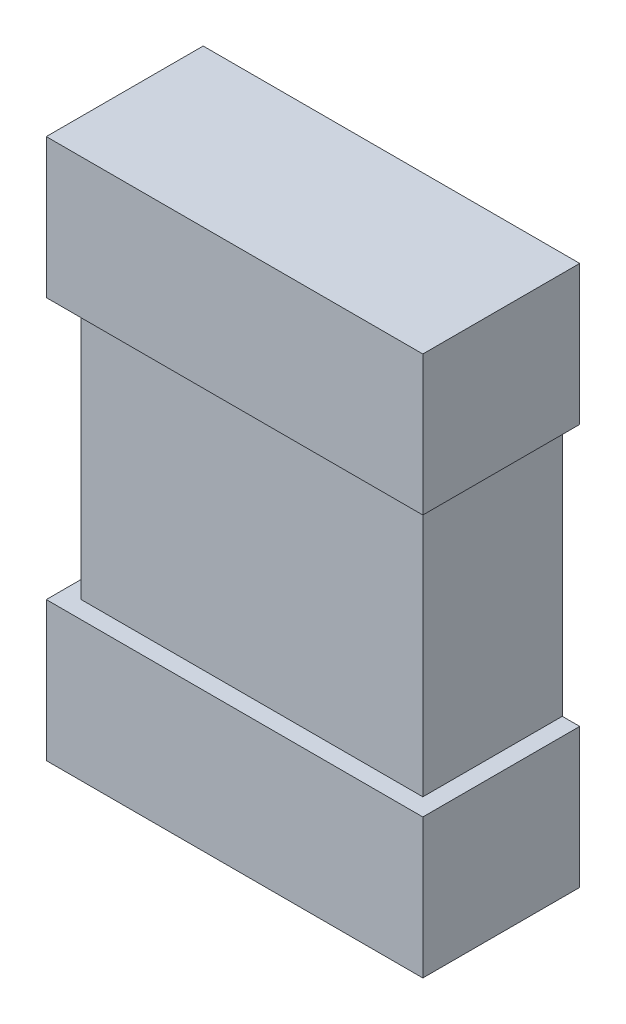
ISO-10303-21;
HEADER;
FILE_DESCRIPTION(('STEP AP214'),'2;1');
FILE_NAME('part.step','',(''),(''),'','','');
FILE_SCHEMA(('AUTOMOTIVE_DESIGN { 1 0 10303 214 1 1 1 1 }'));
ENDSEC;
DATA;
#1=APPLICATION_CONTEXT('core data for automotive mechanical design processes');
#2=APPLICATION_PROTOCOL_DEFINITION('international standard','automotive_design',2000,#1);
#3=PRODUCT_CONTEXT('',#1,'mechanical');
#4=PRODUCT('Part','Part','',(#3));
#5=PRODUCT_RELATED_PRODUCT_CATEGORY('part','',(#4));
#6=PRODUCT_DEFINITION_FORMATION('','',#4);
#7=PRODUCT_DEFINITION_CONTEXT('part definition',#1,'design');
#8=PRODUCT_DEFINITION('design','',#6,#7);
#9=PRODUCT_DEFINITION_SHAPE('','',#8);
#10=(LENGTH_UNIT() NAMED_UNIT(*) SI_UNIT(.MILLI.,.METRE.));
#11=(NAMED_UNIT(*) PLANE_ANGLE_UNIT() SI_UNIT($,.RADIAN.));
#12=(NAMED_UNIT(*) SI_UNIT($,.STERADIAN.) SOLID_ANGLE_UNIT());
#13=UNCERTAINTY_MEASURE_WITH_UNIT(LENGTH_MEASURE(1.E-05),#10,'distance_accuracy_value','');
#14=(GEOMETRIC_REPRESENTATION_CONTEXT(3) GLOBAL_UNCERTAINTY_ASSIGNED_CONTEXT((#13)) GLOBAL_UNIT_ASSIGNED_CONTEXT((#10,
#11,#12)) REPRESENTATION_CONTEXT('',''));
#15=CARTESIAN_POINT('',(0.,0.,0.));
#16=DIRECTION('',(0.,0.,1.));
#17=DIRECTION('',(1.,0.,0.));
#18=AXIS2_PLACEMENT_3D('',#15,#16,#17);
#19=CARTESIAN_POINT('',(-0.54,-0.775,0.45));
#20=DIRECTION('',(0.,0.,1.));
#21=DIRECTION('',(1.,0.,0.));
#22=AXIS2_PLACEMENT_3D('',#19,#20,#21);
#23=PLANE('',#22);
#24=DIRECTION('',(-1.,0.,0.));
#25=VECTOR('',#24,1.);
#26=CARTESIAN_POINT('',(-0.49,0.375,0.45));
#27=LINE('',#26,#25);
#28=CARTESIAN_POINT('',(0.54,0.375,0.45));
#29=VERTEX_POINT('',#28);
#30=CARTESIAN_POINT('',(-0.54,0.375,0.45));
#31=VERTEX_POINT('',#30);
#32=EDGE_CURVE('E154',#29,#31,#27,.T.);
#33=ORIENTED_EDGE('',*,*,#32,.F.);
#34=DIRECTION('',(0.,1.,0.));
#35=VECTOR('',#34,1.);
#36=CARTESIAN_POINT('',(0.54,-0.775,0.45));
#37=LINE('',#36,#35);
#38=CARTESIAN_POINT('',(0.54,0.775,0.45));
#39=VERTEX_POINT('',#38);
#40=EDGE_CURVE('E193',#29,#39,#37,.T.);
#41=ORIENTED_EDGE('',*,*,#40,.T.);
#42=DIRECTION('',(-1.,0.,0.));
#43=VECTOR('',#42,1.);
#44=CARTESIAN_POINT('',(0.54,0.775,0.45));
#45=LINE('',#44,#43);
#46=CARTESIAN_POINT('',(-0.54,0.775,0.45));
#47=VERTEX_POINT('',#46);
#48=EDGE_CURVE('E197',#39,#47,#45,.T.);
#49=ORIENTED_EDGE('',*,*,#48,.T.);
#50=DIRECTION('',(0.,-1.,0.));
#51=VECTOR('',#50,1.);
#52=CARTESIAN_POINT('',(-0.54,0.775,0.45));
#53=LINE('',#52,#51);
#54=EDGE_CURVE('E188',#47,#31,#53,.T.);
#55=ORIENTED_EDGE('',*,*,#54,.T.);
#56=EDGE_LOOP('',(#33,#41,#49,#55));
#57=FACE_BOUND('',#56,.T.);
#58=ADVANCED_FACE('F36',(#57),#23,.T.);
#59=CARTESIAN_POINT('',(0.54,-0.775,0.45));
#60=DIRECTION('',(-1.,0.,0.));
#61=DIRECTION('',(0.,0.,1.));
#62=AXIS2_PLACEMENT_3D('',#59,#60,#61);
#63=PLANE('',#62);
#64=DIRECTION('',(0.,1.,0.));
#65=VECTOR('',#64,1.);
#66=CARTESIAN_POINT('',(0.54,-0.775,0.));
#67=LINE('',#66,#65);
#68=CARTESIAN_POINT('',(0.54,-0.775,0.));
#69=VERTEX_POINT('',#68);
#70=CARTESIAN_POINT('',(0.54,-0.375,0.));
#71=VERTEX_POINT('',#70);
#72=EDGE_CURVE('E182',#69,#71,#67,.T.);
#73=ORIENTED_EDGE('',*,*,#72,.T.);
#74=DIRECTION('',(0.,0.,1.));
#75=VECTOR('',#74,1.);
#76=CARTESIAN_POINT('',(0.54,-0.375,0.));
#77=LINE('',#76,#75);
#78=CARTESIAN_POINT('',(0.54,-0.375,0.45));
#79=VERTEX_POINT('',#78);
#80=EDGE_CURVE('E142',#71,#79,#77,.T.);
#81=ORIENTED_EDGE('',*,*,#80,.T.);
#82=CARTESIAN_POINT('',(0.54,-0.775,0.45));
#83=VERTEX_POINT('',#82);
#84=EDGE_CURVE('E194',#83,#79,#37,.T.);
#85=ORIENTED_EDGE('',*,*,#84,.F.);
#86=DIRECTION('',(0.,0.,-1.));
#87=VECTOR('',#86,1.);
#88=CARTESIAN_POINT('',(0.54,-0.775,0.45));
#89=LINE('',#88,#87);
#90=EDGE_CURVE('E44',#83,#69,#89,.T.);
#91=ORIENTED_EDGE('',*,*,#90,.T.);
#92=EDGE_LOOP('',(#73,#81,#85,#91));
#93=FACE_BOUND('',#92,.T.);
#94=ADVANCED_FACE('F209',(#93),#63,.F.);
#95=CARTESIAN_POINT('',(-0.54,0.775,0.45));
#96=DIRECTION('',(1.,0.,0.));
#97=DIRECTION('',(0.,0.,-1.));
#98=AXIS2_PLACEMENT_3D('',#95,#96,#97);
#99=PLANE('',#98);
#100=DIRECTION('',(0.,-1.,0.));
#101=VECTOR('',#100,1.);
#102=CARTESIAN_POINT('',(-0.54,0.775,0.));
#103=LINE('',#102,#101);
#104=CARTESIAN_POINT('',(-0.54,0.775,0.));
#105=VERTEX_POINT('',#104);
#106=CARTESIAN_POINT('',(-0.54,0.375,0.));
#107=VERTEX_POINT('',#106);
#108=EDGE_CURVE('E176',#105,#107,#103,.T.);
#109=ORIENTED_EDGE('',*,*,#108,.T.);
#110=DIRECTION('',(0.,0.,1.));
#111=VECTOR('',#110,1.);
#112=CARTESIAN_POINT('',(-0.54,0.375,0.));
#113=LINE('',#112,#111);
#114=EDGE_CURVE('E167',#107,#31,#113,.T.);
#115=ORIENTED_EDGE('',*,*,#114,.T.);
#116=ORIENTED_EDGE('',*,*,#54,.F.);
#117=DIRECTION('',(0.,0.,-1.));
#118=VECTOR('',#117,1.);
#119=CARTESIAN_POINT('',(-0.54,0.775,0.45));
#120=LINE('',#119,#118);
#121=EDGE_CURVE('E199',#47,#105,#120,.T.);
#122=ORIENTED_EDGE('',*,*,#121,.T.);
#123=EDGE_LOOP('',(#109,#115,#116,#122));
#124=FACE_BOUND('',#123,.T.);
#125=ADVANCED_FACE('F244',(#124),#99,.F.);
#126=CARTESIAN_POINT('',(-0.54,-0.375,0.45));
#127=VERTEX_POINT('',#126);
#128=CARTESIAN_POINT('',(-0.54,-0.775,0.45));
#129=VERTEX_POINT('',#128);
#130=EDGE_CURVE('E187',#127,#129,#53,.T.);
#131=ORIENTED_EDGE('',*,*,#130,.F.);
#132=DIRECTION('',(0.,0.,1.));
#133=VECTOR('',#132,1.);
#134=CARTESIAN_POINT('',(-0.54,-0.375,0.));
#135=LINE('',#134,#133);
#136=CARTESIAN_POINT('',(-0.54,-0.375,0.));
#137=VERTEX_POINT('',#136);
#138=EDGE_CURVE('E166',#137,#127,#135,.T.);
#139=ORIENTED_EDGE('',*,*,#138,.F.);
#140=CARTESIAN_POINT('',(-0.54,-0.775,0.));
#141=VERTEX_POINT('',#140);
#142=EDGE_CURVE('E169',#137,#141,#103,.T.);
#143=ORIENTED_EDGE('',*,*,#142,.T.);
#144=DIRECTION('',(0.,0.,-1.));
#145=VECTOR('',#144,1.);
#146=CARTESIAN_POINT('',(-0.54,-0.775,0.45));
#147=LINE('',#146,#145);
#148=EDGE_CURVE('E11',#129,#141,#147,.T.);
#149=ORIENTED_EDGE('',*,*,#148,.F.);
#150=EDGE_LOOP('',(#131,#139,#143,#149));
#151=FACE_BOUND('',#150,.T.);
#152=ADVANCED_FACE('F38',(#151),#99,.F.);
#153=CARTESIAN_POINT('',(-0.54,-0.775,0.45));
#154=DIRECTION('',(0.,1.,0.));
#155=DIRECTION('',(0.,0.,1.));
#156=AXIS2_PLACEMENT_3D('',#153,#154,#155);
#157=PLANE('',#156);
#158=DIRECTION('',(1.,0.,0.));
#159=VECTOR('',#158,1.);
#160=CARTESIAN_POINT('',(-0.54,-0.775,0.));
#161=LINE('',#160,#159);
#162=EDGE_CURVE('E179',#141,#69,#161,.T.);
#163=ORIENTED_EDGE('',*,*,#162,.T.);
#164=ORIENTED_EDGE('',*,*,#90,.F.);
#165=DIRECTION('',(1.,0.,0.));
#166=VECTOR('',#165,1.);
#167=CARTESIAN_POINT('',(-0.54,-0.775,0.45));
#168=LINE('',#167,#166);
#169=EDGE_CURVE('E191',#129,#83,#168,.T.);
#170=ORIENTED_EDGE('',*,*,#169,.F.);
#171=ORIENTED_EDGE('',*,*,#148,.T.);
#172=EDGE_LOOP('',(#163,#164,#170,#171));
#173=FACE_BOUND('',#172,.T.);
#174=ADVANCED_FACE('F234',(#173),#157,.F.);
#175=ORIENTED_EDGE('',*,*,#40,.F.);
#176=DIRECTION('',(0.,0.,1.));
#177=VECTOR('',#176,1.);
#178=CARTESIAN_POINT('',(0.54,0.375,0.));
#179=LINE('',#178,#177);
#180=CARTESIAN_POINT('',(0.54,0.375,0.));
#181=VERTEX_POINT('',#180);
#182=EDGE_CURVE('E147',#181,#29,#179,.T.);
#183=ORIENTED_EDGE('',*,*,#182,.F.);
#184=CARTESIAN_POINT('',(0.54,0.775,0.));
#185=VERTEX_POINT('',#184);
#186=EDGE_CURVE('E181',#181,#185,#67,.T.);
#187=ORIENTED_EDGE('',*,*,#186,.T.);
#188=DIRECTION('',(0.,0.,-1.));
#189=VECTOR('',#188,1.);
#190=CARTESIAN_POINT('',(0.54,0.775,0.45));
#191=LINE('',#190,#189);
#192=EDGE_CURVE('E202',#39,#185,#191,.T.);
#193=ORIENTED_EDGE('',*,*,#192,.F.);
#194=EDGE_LOOP('',(#175,#183,#187,#193));
#195=FACE_BOUND('',#194,.T.);
#196=ADVANCED_FACE('F236',(#195),#63,.F.);
#197=CARTESIAN_POINT('',(0.54,0.775,0.45));
#198=DIRECTION('',(0.,-1.,0.));
#199=DIRECTION('',(0.,0.,-1.));
#200=AXIS2_PLACEMENT_3D('',#197,#198,#199);
#201=PLANE('',#200);
#202=DIRECTION('',(-1.,0.,0.));
#203=VECTOR('',#202,1.);
#204=CARTESIAN_POINT('',(0.54,0.775,0.));
#205=LINE('',#204,#203);
#206=EDGE_CURVE('E185',#185,#105,#205,.T.);
#207=ORIENTED_EDGE('',*,*,#206,.T.);
#208=ORIENTED_EDGE('',*,*,#121,.F.);
#209=ORIENTED_EDGE('',*,*,#48,.F.);
#210=ORIENTED_EDGE('',*,*,#192,.T.);
#211=EDGE_LOOP('',(#207,#208,#209,#210));
#212=FACE_BOUND('',#211,.T.);
#213=ADVANCED_FACE('F241',(#212),#201,.F.);
#214=ORIENTED_EDGE('',*,*,#84,.T.);
#215=DIRECTION('',(1.,0.,0.));
#216=VECTOR('',#215,1.);
#217=CARTESIAN_POINT('',(-0.54,-0.375,0.45));
#218=LINE('',#217,#216);
#219=EDGE_CURVE('E145',#127,#79,#218,.T.);
#220=ORIENTED_EDGE('',*,*,#219,.F.);
#221=ORIENTED_EDGE('',*,*,#130,.T.);
#222=ORIENTED_EDGE('',*,*,#169,.T.);
#223=EDGE_LOOP('',(#214,#220,#221,#222));
#224=FACE_BOUND('',#223,.T.);
#225=ADVANCED_FACE('F233',(#224),#23,.T.);
#226=CARTESIAN_POINT('',(-0.54,-0.775,0.));
#227=DIRECTION('',(0.,0.,1.));
#228=DIRECTION('',(1.,0.,0.));
#229=AXIS2_PLACEMENT_3D('',#226,#227,#228);
#230=PLANE('',#229);
#231=DIRECTION('',(0.,-1.,0.));
#232=VECTOR('',#231,1.);
#233=CARTESIAN_POINT('',(0.49,-0.375,0.));
#234=LINE('',#233,#232);
#235=CARTESIAN_POINT('',(0.49,0.375,0.));
#236=VERTEX_POINT('',#235);
#237=CARTESIAN_POINT('',(0.49,-0.375,0.));
#238=VERTEX_POINT('',#237);
#239=EDGE_CURVE('E59',#236,#238,#234,.T.);
#240=ORIENTED_EDGE('',*,*,#239,.T.);
#241=DIRECTION('',(1.,0.,0.));
#242=VECTOR('',#241,1.);
#243=CARTESIAN_POINT('',(0.49,-0.375,0.));
#244=LINE('',#243,#242);
#245=EDGE_CURVE('E141',#238,#71,#244,.T.);
#246=ORIENTED_EDGE('',*,*,#245,.T.);
#247=ORIENTED_EDGE('',*,*,#72,.F.);
#248=ORIENTED_EDGE('',*,*,#162,.F.);
#249=ORIENTED_EDGE('',*,*,#142,.F.);
#250=DIRECTION('',(1.,0.,0.));
#251=VECTOR('',#250,1.);
#252=CARTESIAN_POINT('',(-0.54,-0.375,0.));
#253=LINE('',#252,#251);
#254=CARTESIAN_POINT('',(-0.49,-0.375,0.));
#255=VERTEX_POINT('',#254);
#256=EDGE_CURVE('E157',#137,#255,#253,.T.);
#257=ORIENTED_EDGE('',*,*,#256,.T.);
#258=DIRECTION('',(0.,1.,0.));
#259=VECTOR('',#258,1.);
#260=CARTESIAN_POINT('',(-0.49,0.375,0.));
#261=LINE('',#260,#259);
#262=CARTESIAN_POINT('',(-0.49,0.375,0.));
#263=VERTEX_POINT('',#262);
#264=EDGE_CURVE('E160',#255,#263,#261,.T.);
#265=ORIENTED_EDGE('',*,*,#264,.T.);
#266=DIRECTION('',(-1.,0.,0.));
#267=VECTOR('',#266,1.);
#268=CARTESIAN_POINT('',(-0.49,0.375,0.));
#269=LINE('',#268,#267);
#270=EDGE_CURVE('E163',#263,#107,#269,.T.);
#271=ORIENTED_EDGE('',*,*,#270,.T.);
#272=ORIENTED_EDGE('',*,*,#108,.F.);
#273=ORIENTED_EDGE('',*,*,#206,.F.);
#274=ORIENTED_EDGE('',*,*,#186,.F.);
#275=DIRECTION('',(-1.,0.,0.));
#276=VECTOR('',#275,1.);
#277=CARTESIAN_POINT('',(0.54,0.375,0.));
#278=LINE('',#277,#276);
#279=EDGE_CURVE('E217',#181,#236,#278,.T.);
#280=ORIENTED_EDGE('',*,*,#279,.T.);
#281=EDGE_LOOP('',(#240,#246,#247,#248,#249,#257,#265,#271,#272,#273,#274,#280));
#282=FACE_BOUND('',#281,.T.);
#283=ADVANCED_FACE('F214',(#282),#230,.F.);
#284=CARTESIAN_POINT('',(-0.49,0.375,0.));
#285=DIRECTION('',(0.,1.,0.));
#286=DIRECTION('',(0.,0.,1.));
#287=AXIS2_PLACEMENT_3D('',#284,#285,#286);
#288=PLANE('',#287);
#289=DIRECTION('',(0.,0.,1.));
#290=VECTOR('',#289,1.);
#291=CARTESIAN_POINT('',(-0.49,0.375,0.));
#292=LINE('',#291,#290);
#293=CARTESIAN_POINT('',(-0.49,0.375,0.4));
#294=VERTEX_POINT('',#293);
#295=EDGE_CURVE('E170',#263,#294,#292,.T.);
#296=ORIENTED_EDGE('',*,*,#295,.T.);
#297=DIRECTION('',(1.,0.,0.));
#298=VECTOR('',#297,1.);
#299=CARTESIAN_POINT('',(-0.54,0.375,0.4));
#300=LINE('',#299,#298);
#301=CARTESIAN_POINT('',(0.49,0.375,0.4));
#302=VERTEX_POINT('',#301);
#303=EDGE_CURVE('E132',#294,#302,#300,.T.);
#304=ORIENTED_EDGE('',*,*,#303,.T.);
#305=DIRECTION('',(0.,0.,1.));
#306=VECTOR('',#305,1.);
#307=CARTESIAN_POINT('',(0.49,0.375,0.));
#308=LINE('',#307,#306);
#309=EDGE_CURVE('E137',#236,#302,#308,.T.);
#310=ORIENTED_EDGE('',*,*,#309,.F.);
#311=ORIENTED_EDGE('',*,*,#279,.F.);
#312=ORIENTED_EDGE('',*,*,#182,.T.);
#313=ORIENTED_EDGE('',*,*,#32,.T.);
#314=ORIENTED_EDGE('',*,*,#114,.F.);
#315=ORIENTED_EDGE('',*,*,#270,.F.);
#316=EDGE_LOOP('',(#296,#304,#310,#311,#312,#313,#314,#315));
#317=FACE_BOUND('',#316,.T.);
#318=ADVANCED_FACE('F223',(#317),#288,.F.);
#319=CARTESIAN_POINT('',(-0.49,0.375,0.));
#320=DIRECTION('',(1.,0.,0.));
#321=DIRECTION('',(0.,0.,-1.));
#322=AXIS2_PLACEMENT_3D('',#319,#320,#321);
#323=PLANE('',#322);
#324=DIRECTION('',(0.,0.,1.));
#325=VECTOR('',#324,1.);
#326=CARTESIAN_POINT('',(-0.49,-0.375,0.));
#327=LINE('',#326,#325);
#328=CARTESIAN_POINT('',(-0.49,-0.375,0.4));
#329=VERTEX_POINT('',#328);
#330=EDGE_CURVE('E173',#255,#329,#327,.T.);
#331=ORIENTED_EDGE('',*,*,#330,.T.);
#332=DIRECTION('',(0.,1.,0.));
#333=VECTOR('',#332,1.);
#334=CARTESIAN_POINT('',(-0.49,0.375,0.4));
#335=LINE('',#334,#333);
#336=EDGE_CURVE('E127',#329,#294,#335,.T.);
#337=ORIENTED_EDGE('',*,*,#336,.T.);
#338=ORIENTED_EDGE('',*,*,#295,.F.);
#339=ORIENTED_EDGE('',*,*,#264,.F.);
#340=EDGE_LOOP('',(#331,#337,#338,#339));
#341=FACE_BOUND('',#340,.T.);
#342=ADVANCED_FACE('F226',(#341),#323,.F.);
#343=CARTESIAN_POINT('',(-0.54,-0.375,0.));
#344=DIRECTION('',(0.,-1.,0.));
#345=DIRECTION('',(1.,0.,0.));
#346=AXIS2_PLACEMENT_3D('',#343,#344,#345);
#347=PLANE('',#346);
#348=ORIENTED_EDGE('',*,*,#138,.T.);
#349=ORIENTED_EDGE('',*,*,#219,.T.);
#350=ORIENTED_EDGE('',*,*,#80,.F.);
#351=ORIENTED_EDGE('',*,*,#245,.F.);
#352=DIRECTION('',(0.,0.,1.));
#353=VECTOR('',#352,1.);
#354=CARTESIAN_POINT('',(0.49,-0.375,0.));
#355=LINE('',#354,#353);
#356=CARTESIAN_POINT('',(0.49,-0.375,0.4));
#357=VERTEX_POINT('',#356);
#358=EDGE_CURVE('E135',#238,#357,#355,.T.);
#359=ORIENTED_EDGE('',*,*,#358,.T.);
#360=DIRECTION('',(1.,0.,0.));
#361=VECTOR('',#360,1.);
#362=CARTESIAN_POINT('',(-0.54,-0.375,0.4));
#363=LINE('',#362,#361);
#364=EDGE_CURVE('E124',#329,#357,#363,.T.);
#365=ORIENTED_EDGE('',*,*,#364,.F.);
#366=ORIENTED_EDGE('',*,*,#330,.F.);
#367=ORIENTED_EDGE('',*,*,#256,.F.);
#368=EDGE_LOOP('',(#348,#349,#350,#351,#359,#365,#366,#367));
#369=FACE_BOUND('',#368,.T.);
#370=ADVANCED_FACE('F139',(#369),#347,.F.);
#371=CARTESIAN_POINT('',(0.49,-0.375,0.));
#372=DIRECTION('',(-1.,0.,0.));
#373=DIRECTION('',(0.,0.,1.));
#374=AXIS2_PLACEMENT_3D('',#371,#372,#373);
#375=PLANE('',#374);
#376=ORIENTED_EDGE('',*,*,#309,.T.);
#377=DIRECTION('',(0.,1.,0.));
#378=VECTOR('',#377,1.);
#379=CARTESIAN_POINT('',(0.49,0.375,0.4));
#380=LINE('',#379,#378);
#381=EDGE_CURVE('E51',#357,#302,#380,.T.);
#382=ORIENTED_EDGE('',*,*,#381,.F.);
#383=ORIENTED_EDGE('',*,*,#358,.F.);
#384=ORIENTED_EDGE('',*,*,#239,.F.);
#385=EDGE_LOOP('',(#376,#382,#383,#384));
#386=FACE_BOUND('',#385,.T.);
#387=ADVANCED_FACE('F134',(#386),#375,.F.);
#388=CARTESIAN_POINT('',(-0.54,0.375,0.4));
#389=DIRECTION('',(0.,0.,-1.));
#390=DIRECTION('',(-1.,0.,0.));
#391=AXIS2_PLACEMENT_3D('',#388,#389,#390);
#392=PLANE('',#391);
#393=ORIENTED_EDGE('',*,*,#364,.T.);
#394=ORIENTED_EDGE('',*,*,#381,.T.);
#395=ORIENTED_EDGE('',*,*,#303,.F.);
#396=ORIENTED_EDGE('',*,*,#336,.F.);
#397=EDGE_LOOP('',(#393,#394,#395,#396));
#398=FACE_BOUND('',#397,.T.);
#399=ADVANCED_FACE('F125',(#398),#392,.F.);
#400=CLOSED_SHELL('',(#58,#94,#125,#152,#174,#196,#213,#225,#283,#318,#342,#370,#387,#399));
#401=MANIFOLD_SOLID_BREP('B2',#400);
#402=ADVANCED_BREP_SHAPE_REPRESENTATION('',(#18,#401),#14);
#403=SHAPE_DEFINITION_REPRESENTATION(#9,#402);
ENDSEC;
END-ISO-10303-21;
